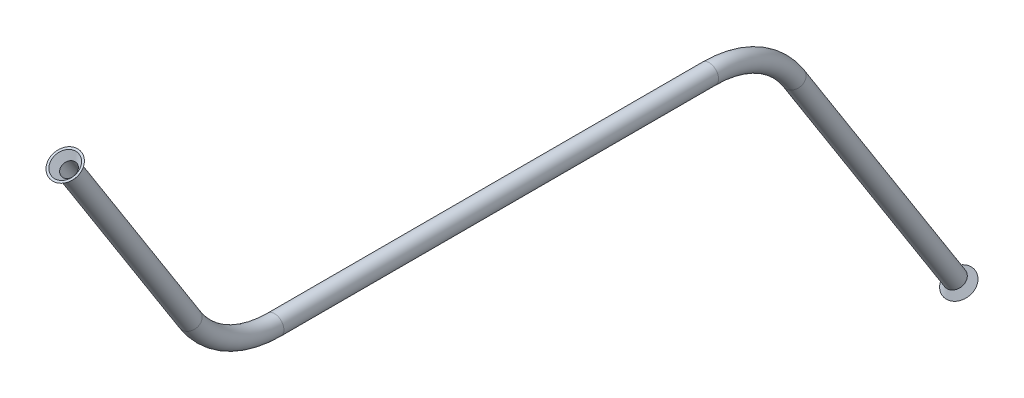
ISO-10303-21;
HEADER;
FILE_DESCRIPTION(('STEP AP214'),'2;1');
FILE_NAME('part.step','',(''),(''),'','','');
FILE_SCHEMA(('AUTOMOTIVE_DESIGN { 1 0 10303 214 1 1 1 1 }'));
ENDSEC;
DATA;
#1=APPLICATION_CONTEXT('core data for automotive mechanical design processes');
#2=APPLICATION_PROTOCOL_DEFINITION('international standard','automotive_design',2000,#1);
#3=PRODUCT_CONTEXT('',#1,'mechanical');
#4=PRODUCT('Part','Part','',(#3));
#5=PRODUCT_RELATED_PRODUCT_CATEGORY('part','',(#4));
#6=PRODUCT_DEFINITION_FORMATION('','',#4);
#7=PRODUCT_DEFINITION_CONTEXT('part definition',#1,'design');
#8=PRODUCT_DEFINITION('design','',#6,#7);
#9=PRODUCT_DEFINITION_SHAPE('','',#8);
#10=(LENGTH_UNIT() NAMED_UNIT(*) SI_UNIT(.MILLI.,.METRE.));
#11=(NAMED_UNIT(*) PLANE_ANGLE_UNIT() SI_UNIT($,.RADIAN.));
#12=(NAMED_UNIT(*) SI_UNIT($,.STERADIAN.) SOLID_ANGLE_UNIT());
#13=UNCERTAINTY_MEASURE_WITH_UNIT(LENGTH_MEASURE(1.E-05),#10,'distance_accuracy_value','');
#14=(GEOMETRIC_REPRESENTATION_CONTEXT(3) GLOBAL_UNCERTAINTY_ASSIGNED_CONTEXT((#13)) GLOBAL_UNIT_ASSIGNED_CONTEXT((#10,
#11,#12)) REPRESENTATION_CONTEXT('',''));
#15=CARTESIAN_POINT('',(0.,0.,0.));
#16=DIRECTION('',(0.,0.,1.));
#17=DIRECTION('',(1.,0.,0.));
#18=AXIS2_PLACEMENT_3D('',#15,#16,#17);
#19=CARTESIAN_POINT('',(0.,-11.780015852977,-131.570297463734));
#20=DIRECTION('',(0.,-0.844078357903194,-0.536219848307993));
#21=DIRECTION('',(0.,0.536219848307993,-0.844078357903194));
#22=AXIS2_PLACEMENT_3D('',#19,#20,#21);
#23=CYLINDRICAL_SURFACE('',#22,2.38125);
#24=CARTESIAN_POINT('',(0.,-11.780015852977,-131.570297463734));
#25=DIRECTION('',(0.,0.844078357903194,0.536219848307994));
#26=DIRECTION('',(1.,0.,0.));
#27=AXIS2_PLACEMENT_3D('',#24,#25,#26);
#28=CIRCLE('',#27,2.38125);
#29=CARTESIAN_POINT('',(0.,-10.5031423391936,-133.580259053491));
#30=VERTEX_POINT('',#29);
#31=EDGE_CURVE('E10',#30,#30,#28,.T.);
#32=ORIENTED_EDGE('',*,*,#31,.F.);
#33=EDGE_LOOP('',(#32));
#34=FACE_BOUND('',#33,.T.);
#35=CARTESIAN_POINT('',(0.,-76.0987867252004,-172.430249904804));
#36=DIRECTION('',(0.,-0.844078357903194,-0.536219848307994));
#37=DIRECTION('',(0.,0.536219848307994,-0.844078357903194));
#38=AXIS2_PLACEMENT_3D('',#35,#36,#37);
#39=CIRCLE('',#38,2.38125);
#40=CARTESIAN_POINT('',(0.,-74.821913211417,-174.440211494561));
#41=VERTEX_POINT('',#40);
#42=EDGE_CURVE('E79',#41,#41,#39,.T.);
#43=ORIENTED_EDGE('',*,*,#42,.F.);
#44=EDGE_LOOP('',(#43));
#45=FACE_BOUND('',#44,.T.);
#46=ADVANCED_FACE('F41',(#34,#45),#23,.T.);
#47=CARTESIAN_POINT('',(0.,-11.780015852977,-131.570297463734));
#48=DIRECTION('',(0.,-0.844078357903194,-0.536219848307993));
#49=DIRECTION('',(0.,0.536219848307993,-0.844078357903194));
#50=AXIS2_PLACEMENT_3D('',#47,#48,#49);
#51=CYLINDRICAL_SURFACE('',#50,1.82245);
#52=CARTESIAN_POINT('',(0.,-11.780015852977,-131.570297463734));
#53=DIRECTION('',(0.,0.844078357903194,0.536219848307994));
#54=DIRECTION('',(1.,0.,0.));
#55=AXIS2_PLACEMENT_3D('',#52,#53,#54);
#56=CIRCLE('',#55,1.82245);
#57=CARTESIAN_POINT('',(0.,-10.8027819904281,-133.108588067095));
#58=VERTEX_POINT('',#57);
#59=EDGE_CURVE('E49',#58,#58,#56,.T.);
#60=ORIENTED_EDGE('',*,*,#59,.T.);
#61=EDGE_LOOP('',(#60));
#62=FACE_BOUND('',#61,.T.);
#63=CARTESIAN_POINT('',(0.,-76.0987867252004,-172.430249904804));
#64=DIRECTION('',(0.,0.844078357903194,0.536219848307994));
#65=DIRECTION('',(0.,-0.536219848307994,0.844078357903194));
#66=AXIS2_PLACEMENT_3D('',#63,#64,#65);
#67=CIRCLE('',#66,1.82245000000001);
#68=CARTESIAN_POINT('',(0.,-77.0760205877493,-170.891959301443));
#69=VERTEX_POINT('',#68);
#70=EDGE_CURVE('E141',#69,#69,#67,.T.);
#71=ORIENTED_EDGE('',*,*,#70,.F.);
#72=EDGE_LOOP('',(#71));
#73=FACE_BOUND('',#72,.T.);
#74=ADVANCED_FACE('F127',(#62,#73),#51,.F.);
#75=CARTESIAN_POINT('',(0.,-25.4,-110.130707172993));
#76=DIRECTION('',(-1.,0.,0.));
#77=DIRECTION('',(0.,0.,1.));
#78=AXIS2_PLACEMENT_3D('',#75,#76,#77);
#79=TOROIDAL_SURFACE('',#78,25.4,2.38125);
#80=CARTESIAN_POINT('',(0.,0.,-110.130707172993));
#81=DIRECTION('',(0.,0.,1.));
#82=DIRECTION('',(1.,0.,0.));
#83=AXIS2_PLACEMENT_3D('',#80,#81,#82);
#84=CIRCLE('',#83,2.38125);
#85=CARTESIAN_POINT('',(0.,2.38125000000001,-110.130707172993));
#86=VERTEX_POINT('',#85);
#87=EDGE_CURVE('E56',#86,#86,#84,.T.);
#88=CARTESIAN_POINT('',(0.,-25.4,-110.130707172993));
#89=DIRECTION('',(-1.,0.,0.));
#90=DIRECTION('',(0.,0.,1.));
#91=AXIS2_PLACEMENT_3D('',#88,#89,#90);
#92=CIRCLE('',#91,27.78125);
#93=EDGE_CURVE('',#86,#30,#92,.T.);
#94=ORIENTED_EDGE('',*,*,#87,.F.);
#95=ORIENTED_EDGE('',*,*,#31,.T.);
#96=ORIENTED_EDGE('',*,*,#93,.T.);
#97=ORIENTED_EDGE('',*,*,#93,.F.);
#98=EDGE_LOOP('',(#94,#96,#95,#97));
#99=FACE_BOUND('',#98,.T.);
#100=ADVANCED_FACE('F132',(#99),#79,.T.);
#101=CARTESIAN_POINT('',(0.,-25.4,-110.130707172993));
#102=DIRECTION('',(-1.,0.,0.));
#103=DIRECTION('',(0.,0.,1.));
#104=AXIS2_PLACEMENT_3D('',#101,#102,#103);
#105=TOROIDAL_SURFACE('',#104,25.4,1.82245);
#106=CARTESIAN_POINT('',(0.,0.,-110.130707172993));
#107=DIRECTION('',(0.,0.,1.));
#108=DIRECTION('',(1.,0.,0.));
#109=AXIS2_PLACEMENT_3D('',#106,#107,#108);
#110=CIRCLE('',#109,1.82245);
#111=CARTESIAN_POINT('',(0.,1.82245000000001,-110.130707172993));
#112=VERTEX_POINT('',#111);
#113=EDGE_CURVE('E98',#112,#112,#110,.T.);
#114=CARTESIAN_POINT('',(0.,-25.4,-110.130707172993));
#115=DIRECTION('',(-1.,0.,0.));
#116=DIRECTION('',(0.,0.,1.));
#117=AXIS2_PLACEMENT_3D('',#114,#115,#116);
#118=CIRCLE('',#117,27.22245);
#119=EDGE_CURVE('',#112,#58,#118,.T.);
#120=ORIENTED_EDGE('',*,*,#113,.T.);
#121=ORIENTED_EDGE('',*,*,#59,.F.);
#122=ORIENTED_EDGE('',*,*,#119,.T.);
#123=ORIENTED_EDGE('',*,*,#119,.F.);
#124=EDGE_LOOP('',(#120,#122,#121,#123));
#125=FACE_BOUND('',#124,.T.);
#126=ADVANCED_FACE('F123',(#125),#105,.F.);
#127=CARTESIAN_POINT('',(0.,0.,-110.130707172993));
#128=DIRECTION('',(0.,0.,1.));
#129=DIRECTION('',(0.,-1.,0.));
#130=AXIS2_PLACEMENT_3D('',#127,#128,#129);
#131=CYLINDRICAL_SURFACE('',#130,1.82245);
#132=ORIENTED_EDGE('',*,*,#113,.F.);
#133=EDGE_LOOP('',(#132));
#134=FACE_BOUND('',#133,.T.);
#135=CARTESIAN_POINT('',(0.,0.,0.));
#136=DIRECTION('',(0.,0.,1.));
#137=DIRECTION('',(1.,0.,0.));
#138=AXIS2_PLACEMENT_3D('',#135,#136,#137);
#139=CIRCLE('',#138,1.82245);
#140=CARTESIAN_POINT('',(0.,-1.82245,0.));
#141=VERTEX_POINT('',#140);
#142=EDGE_CURVE('E68',#141,#141,#139,.T.);
#143=ORIENTED_EDGE('',*,*,#142,.T.);
#144=EDGE_LOOP('',(#143));
#145=FACE_BOUND('',#144,.T.);
#146=ADVANCED_FACE('F113',(#134,#145),#131,.F.);
#147=CARTESIAN_POINT('',(0.,0.,-110.130707172993));
#148=DIRECTION('',(0.,0.,1.));
#149=DIRECTION('',(0.,-1.,0.));
#150=AXIS2_PLACEMENT_3D('',#147,#148,#149);
#151=CYLINDRICAL_SURFACE('',#150,2.38125);
#152=ORIENTED_EDGE('',*,*,#87,.T.);
#153=EDGE_LOOP('',(#152));
#154=FACE_BOUND('',#153,.T.);
#155=CARTESIAN_POINT('',(0.,0.,0.));
#156=DIRECTION('',(0.,0.,1.));
#157=DIRECTION('',(1.,0.,0.));
#158=AXIS2_PLACEMENT_3D('',#155,#156,#157);
#159=CIRCLE('',#158,2.38125);
#160=CARTESIAN_POINT('',(0.,-2.38124999999999,0.));
#161=VERTEX_POINT('',#160);
#162=EDGE_CURVE('E97',#161,#161,#159,.T.);
#163=ORIENTED_EDGE('',*,*,#162,.F.);
#164=EDGE_LOOP('',(#163));
#165=FACE_BOUND('',#164,.T.);
#166=ADVANCED_FACE('F110',(#154,#165),#151,.T.);
#167=CARTESIAN_POINT('',(0.,11.780015852977,21.4395902907411));
#168=DIRECTION('',(0.,0.844078357903194,0.536219848307993));
#169=DIRECTION('',(0.,-0.536219848307993,0.844078357903195));
#170=AXIS2_PLACEMENT_3D('',#167,#168,#169);
#171=CYLINDRICAL_SURFACE('',#170,2.38125);
#172=CARTESIAN_POINT('',(0.,11.780015852977,21.4395902907411));
#173=DIRECTION('',(0.,0.844078357903194,0.536219848307993));
#174=DIRECTION('',(1.,0.,0.));
#175=AXIS2_PLACEMENT_3D('',#172,#173,#174);
#176=CIRCLE('',#175,2.38125);
#177=CARTESIAN_POINT('',(0.,10.5031423391936,23.4495518804981));
#178=VERTEX_POINT('',#177);
#179=EDGE_CURVE('E90',#178,#178,#176,.T.);
#180=ORIENTED_EDGE('',*,*,#179,.T.);
#181=EDGE_LOOP('',(#180));
#182=FACE_BOUND('',#181,.T.);
#183=CARTESIAN_POINT('',(0.,60.0190940071445,52.0845546215429));
#184=DIRECTION('',(0.,0.844078357903194,0.536219848307993));
#185=DIRECTION('',(1.,0.,0.));
#186=AXIS2_PLACEMENT_3D('',#183,#184,#185);
#187=CIRCLE('',#186,2.38125);
#188=CARTESIAN_POINT('',(2.38125,60.0190940071445,52.0845546215429));
#189=VERTEX_POINT('',#188);
#190=EDGE_CURVE('E94',#189,#189,#187,.T.);
#191=ORIENTED_EDGE('',*,*,#190,.F.);
#192=EDGE_LOOP('',(#191));
#193=FACE_BOUND('',#192,.T.);
#194=ADVANCED_FACE('F112',(#182,#193),#171,.T.);
#195=CARTESIAN_POINT('',(0.,11.780015852977,21.4395902907411));
#196=DIRECTION('',(0.,0.844078357903194,0.536219848307993));
#197=DIRECTION('',(0.,-0.536219848307993,0.844078357903195));
#198=AXIS2_PLACEMENT_3D('',#195,#196,#197);
#199=CYLINDRICAL_SURFACE('',#198,1.82245);
#200=CARTESIAN_POINT('',(0.,11.780015852977,21.4395902907411));
#201=DIRECTION('',(0.,0.844078357903194,0.536219848307993));
#202=DIRECTION('',(1.,0.,0.));
#203=AXIS2_PLACEMENT_3D('',#200,#201,#202);
#204=CIRCLE('',#203,1.82245);
#205=CARTESIAN_POINT('',(0.,10.8027819904281,22.9778808941018));
#206=VERTEX_POINT('',#205);
#207=EDGE_CURVE('E86',#206,#206,#204,.T.);
#208=ORIENTED_EDGE('',*,*,#207,.F.);
#209=EDGE_LOOP('',(#208));
#210=FACE_BOUND('',#209,.T.);
#211=CARTESIAN_POINT('',(0.,60.0190940071446,52.084554621543));
#212=DIRECTION('',(0.,-0.844078357903194,-0.536219848307994));
#213=DIRECTION('',(0.,0.536219848307994,-0.844078357903194));
#214=AXIS2_PLACEMENT_3D('',#211,#212,#213);
#215=CIRCLE('',#214,1.82245);
#216=CARTESIAN_POINT('',(0.,60.9963278696935,50.5462640181823));
#217=VERTEX_POINT('',#216);
#218=EDGE_CURVE('E63',#217,#217,#215,.T.);
#219=ORIENTED_EDGE('',*,*,#218,.F.);
#220=EDGE_LOOP('',(#219));
#221=FACE_BOUND('',#220,.T.);
#222=ADVANCED_FACE('F120',(#210,#221),#199,.F.);
#223=CARTESIAN_POINT('',(0.,25.4,0.));
#224=DIRECTION('',(1.,0.,0.));
#225=DIRECTION('',(0.,0.,-1.));
#226=AXIS2_PLACEMENT_3D('',#223,#224,#225);
#227=TOROIDAL_SURFACE('',#226,25.4,1.82245);
#228=CARTESIAN_POINT('',(0.,25.4,0.));
#229=DIRECTION('',(1.,0.,0.));
#230=DIRECTION('',(0.,0.,-1.));
#231=AXIS2_PLACEMENT_3D('',#228,#229,#230);
#232=CIRCLE('',#231,27.22245);
#233=EDGE_CURVE('',#206,#141,#232,.T.);
#234=ORIENTED_EDGE('',*,*,#207,.T.);
#235=ORIENTED_EDGE('',*,*,#142,.F.);
#236=ORIENTED_EDGE('',*,*,#233,.T.);
#237=ORIENTED_EDGE('',*,*,#233,.F.);
#238=EDGE_LOOP('',(#234,#236,#235,#237));
#239=FACE_BOUND('',#238,.T.);
#240=ADVANCED_FACE('F173',(#239),#227,.F.);
#241=CARTESIAN_POINT('',(0.,25.4,0.));
#242=DIRECTION('',(1.,0.,0.));
#243=DIRECTION('',(0.,0.,-1.));
#244=AXIS2_PLACEMENT_3D('',#241,#242,#243);
#245=TOROIDAL_SURFACE('',#244,25.4,2.38125);
#246=CARTESIAN_POINT('',(0.,25.4,0.));
#247=DIRECTION('',(1.,0.,0.));
#248=DIRECTION('',(0.,0.,-1.));
#249=AXIS2_PLACEMENT_3D('',#246,#247,#248);
#250=CIRCLE('',#249,27.78125);
#251=EDGE_CURVE('',#178,#161,#250,.T.);
#252=ORIENTED_EDGE('',*,*,#179,.F.);
#253=ORIENTED_EDGE('',*,*,#162,.T.);
#254=ORIENTED_EDGE('',*,*,#251,.T.);
#255=ORIENTED_EDGE('',*,*,#251,.F.);
#256=EDGE_LOOP('',(#252,#254,#253,#255));
#257=FACE_BOUND('',#256,.T.);
#258=ADVANCED_FACE('F108',(#257),#245,.T.);
#259=CARTESIAN_POINT('',(0.,61.5198653274964,53.0379535118346));
#260=DIRECTION('',(0.,0.844078357903194,0.536219848307994));
#261=DIRECTION('',(0.,-0.536219848307994,0.844078357903194));
#262=AXIS2_PLACEMENT_3D('',#259,#260,#261);
#263=PLANE('',#262);
#264=CARTESIAN_POINT('',(0.,61.5198653274964,53.0379535118346));
#265=DIRECTION('',(0.,0.844078357903194,0.536219848307994));
#266=DIRECTION('',(0.,-0.536219848307994,0.844078357903194));
#267=AXIS2_PLACEMENT_3D('',#264,#265,#266);
#268=CIRCLE('',#267,3.16226910108276);
#269=CARTESIAN_POINT('',(0.,59.8241938698048,55.7071564219245));
#270=VERTEX_POINT('',#269);
#271=EDGE_CURVE('E59',#270,#270,#268,.T.);
#272=ORIENTED_EDGE('',*,*,#271,.F.);
#273=EDGE_LOOP('',(#272));
#274=FACE_BOUND('',#273,.T.);
#275=CARTESIAN_POINT('',(0.,61.5198653274964,53.0379535118346));
#276=DIRECTION('',(0.,0.844078357903194,0.536219848307994));
#277=DIRECTION('',(0.,-0.536219848307994,0.844078357903194));
#278=AXIS2_PLACEMENT_3D('',#275,#276,#277);
#279=CIRCLE('',#278,3.72106910108278);
#280=CARTESIAN_POINT('',(0.,59.5245542185703,56.1788274083208));
#281=VERTEX_POINT('',#280);
#282=EDGE_CURVE('E62',#281,#281,#279,.T.);
#283=ORIENTED_EDGE('',*,*,#282,.T.);
#284=EDGE_LOOP('',(#283));
#285=FACE_BOUND('',#284,.T.);
#286=ADVANCED_FACE('F166',(#274,#285),#263,.T.);
#287=CARTESIAN_POINT('',(0.,60.0190940071446,52.0845546215429));
#288=DIRECTION('',(0.,0.844078357903194,0.536219848307994));
#289=DIRECTION('',(0.,-0.536219848307994,0.844078357903194));
#290=AXIS2_PLACEMENT_3D('',#287,#288,#289);
#291=CONICAL_SURFACE('',#290,2.38125,0.645771823237903);
#292=ORIENTED_EDGE('',*,*,#282,.F.);
#293=EDGE_LOOP('',(#292));
#294=FACE_BOUND('',#293,.T.);
#295=ORIENTED_EDGE('',*,*,#190,.T.);
#296=EDGE_LOOP('',(#295));
#297=FACE_BOUND('',#296,.T.);
#298=ADVANCED_FACE('F165',(#294,#297),#291,.T.);
#299=CARTESIAN_POINT('',(0.,60.0190940071446,52.084554621543));
#300=DIRECTION('',(0.,0.844078357903194,0.536219848307994));
#301=DIRECTION('',(0.,0.536219848307994,-0.844078357903194));
#302=AXIS2_PLACEMENT_3D('',#299,#300,#301);
#303=CONICAL_SURFACE('',#302,1.82245,0.645771823237903);
#304=ORIENTED_EDGE('',*,*,#271,.T.);
#305=EDGE_LOOP('',(#304));
#306=FACE_BOUND('',#305,.T.);
#307=ORIENTED_EDGE('',*,*,#218,.T.);
#308=EDGE_LOOP('',(#307));
#309=FACE_BOUND('',#308,.T.);
#310=ADVANCED_FACE('F160',(#306,#309),#303,.F.);
#311=CARTESIAN_POINT('',(0.,-77.5995580455523,-173.383648795095));
#312=DIRECTION('',(0.,-0.844078357903194,-0.536219848307994));
#313=DIRECTION('',(0.,0.536219848307994,-0.844078357903194));
#314=AXIS2_PLACEMENT_3D('',#311,#312,#313);
#315=PLANE('',#314);
#316=CARTESIAN_POINT('',(0.,-77.5995580455523,-173.383648795095));
#317=DIRECTION('',(0.,-0.844078357903194,-0.536219848307994));
#318=DIRECTION('',(0.,0.536219848307994,-0.844078357903194));
#319=AXIS2_PLACEMENT_3D('',#316,#317,#318);
#320=CIRCLE('',#319,3.16226910108278);
#321=CARTESIAN_POINT('',(0.,-75.9038865878606,-176.052851705185));
#322=VERTEX_POINT('',#321);
#323=EDGE_CURVE('E44',#322,#322,#320,.T.);
#324=ORIENTED_EDGE('',*,*,#323,.F.);
#325=EDGE_LOOP('',(#324));
#326=FACE_BOUND('',#325,.T.);
#327=CARTESIAN_POINT('',(0.,-77.5995580455523,-173.383648795095));
#328=DIRECTION('',(0.,-0.844078357903194,-0.536219848307994));
#329=DIRECTION('',(0.,0.536219848307994,-0.844078357903194));
#330=AXIS2_PLACEMENT_3D('',#327,#328,#329);
#331=CIRCLE('',#330,3.72106910108277);
#332=CARTESIAN_POINT('',(0.,-75.6042469366261,-176.524522691581));
#333=VERTEX_POINT('',#332);
#334=EDGE_CURVE('E72',#333,#333,#331,.T.);
#335=ORIENTED_EDGE('',*,*,#334,.T.);
#336=EDGE_LOOP('',(#335));
#337=FACE_BOUND('',#336,.T.);
#338=ADVANCED_FACE('F155',(#326,#337),#315,.T.);
#339=CARTESIAN_POINT('',(0.,-76.0987867252004,-172.430249904804));
#340=DIRECTION('',(0.,-0.844078357903194,-0.536219848307994));
#341=DIRECTION('',(0.,0.536219848307994,-0.844078357903194));
#342=AXIS2_PLACEMENT_3D('',#339,#340,#341);
#343=CONICAL_SURFACE('',#342,2.38125,0.645771823237903);
#344=ORIENTED_EDGE('',*,*,#334,.F.);
#345=EDGE_LOOP('',(#344));
#346=FACE_BOUND('',#345,.T.);
#347=ORIENTED_EDGE('',*,*,#42,.T.);
#348=EDGE_LOOP('',(#347));
#349=FACE_BOUND('',#348,.T.);
#350=ADVANCED_FACE('F149',(#346,#349),#343,.T.);
#351=CARTESIAN_POINT('',(0.,-76.0987867252004,-172.430249904804));
#352=DIRECTION('',(0.,-0.844078357903194,-0.536219848307994));
#353=DIRECTION('',(0.,-0.536219848307994,0.844078357903194));
#354=AXIS2_PLACEMENT_3D('',#351,#352,#353);
#355=CONICAL_SURFACE('',#354,1.82245000000001,0.645771823237903);
#356=ORIENTED_EDGE('',*,*,#323,.T.);
#357=EDGE_LOOP('',(#356));
#358=FACE_BOUND('',#357,.T.);
#359=ORIENTED_EDGE('',*,*,#70,.T.);
#360=EDGE_LOOP('',(#359));
#361=FACE_BOUND('',#360,.T.);
#362=ADVANCED_FACE('F146',(#358,#361),#355,.F.);
#363=CLOSED_SHELL('',(#46,#74,#100,#126,#146,#166,#194,#222,#240,#258,#286,#298,#310,#338,#350,#362));
#364=MANIFOLD_SOLID_BREP('B2',#363);
#365=ADVANCED_BREP_SHAPE_REPRESENTATION('',(#18,#364),#14);
#366=SHAPE_DEFINITION_REPRESENTATION(#9,#365);
ENDSEC;
END-ISO-10303-21;
